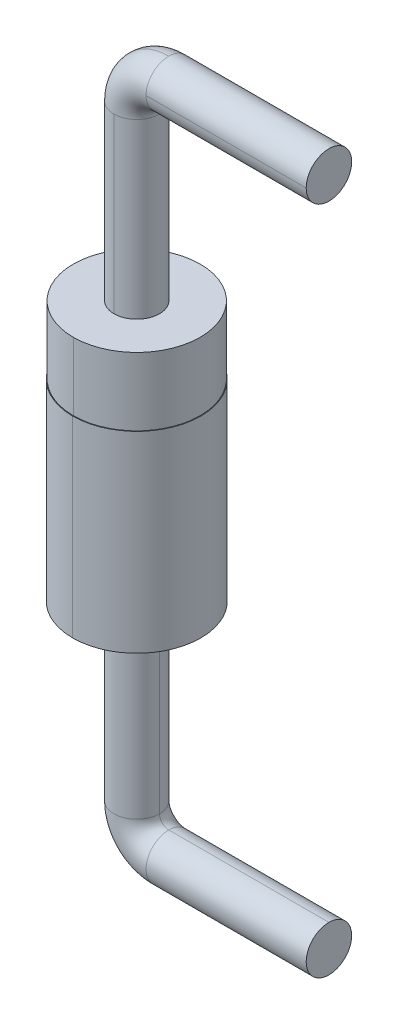
ISO-10303-21;
HEADER;
FILE_DESCRIPTION(('STEP AP214'),'2;1');
FILE_NAME('part.step','',(''),(''),'','','');
FILE_SCHEMA(('AUTOMOTIVE_DESIGN { 1 0 10303 214 1 1 1 1 }'));
ENDSEC;
DATA;
#1=APPLICATION_CONTEXT('core data for automotive mechanical design processes');
#2=APPLICATION_PROTOCOL_DEFINITION('international standard','automotive_design',2000,#1);
#3=PRODUCT_CONTEXT('',#1,'mechanical');
#4=PRODUCT('Part','Part','',(#3));
#5=PRODUCT_RELATED_PRODUCT_CATEGORY('part','',(#4));
#6=PRODUCT_DEFINITION_FORMATION('','',#4);
#7=PRODUCT_DEFINITION_CONTEXT('part definition',#1,'design');
#8=PRODUCT_DEFINITION('design','',#6,#7);
#9=PRODUCT_DEFINITION_SHAPE('','',#8);
#10=(LENGTH_UNIT() NAMED_UNIT(*) SI_UNIT(.MILLI.,.METRE.));
#11=(NAMED_UNIT(*) PLANE_ANGLE_UNIT() SI_UNIT($,.RADIAN.));
#12=(NAMED_UNIT(*) SI_UNIT($,.STERADIAN.) SOLID_ANGLE_UNIT());
#13=UNCERTAINTY_MEASURE_WITH_UNIT(LENGTH_MEASURE(1.E-05),#10,'distance_accuracy_value','');
#14=(GEOMETRIC_REPRESENTATION_CONTEXT(3) GLOBAL_UNCERTAINTY_ASSIGNED_CONTEXT((#13)) GLOBAL_UNIT_ASSIGNED_CONTEXT((#10,
#11,#12)) REPRESENTATION_CONTEXT('',''));
#15=CARTESIAN_POINT('',(0.,0.,0.));
#16=DIRECTION('',(0.,0.,1.));
#17=DIRECTION('',(1.,0.,0.));
#18=AXIS2_PLACEMENT_3D('',#15,#16,#17);
#19=CARTESIAN_POINT('',(3.,-3.2,0.));
#20=DIRECTION('',(1.,0.,0.));
#21=DIRECTION('',(0.,1.,0.));
#22=AXIS2_PLACEMENT_3D('',#19,#20,#21);
#23=PLANE('',#22);
#24=CARTESIAN_POINT('',(3.,-3.2,0.));
#25=DIRECTION('',(1.,0.,0.));
#26=DIRECTION('',(0.,0.,-1.));
#27=AXIS2_PLACEMENT_3D('',#24,#25,#26);
#28=CIRCLE('',#27,0.355);
#29=CARTESIAN_POINT('',(3.,-2.845,0.));
#30=VERTEX_POINT('',#29);
#31=CARTESIAN_POINT('',(3.,-3.555,0.));
#32=VERTEX_POINT('',#31);
#33=EDGE_CURVE('E278',#30,#32,#28,.T.);
#34=ORIENTED_EDGE('',*,*,#33,.T.);
#35=CARTESIAN_POINT('',(3.,-3.2,0.));
#36=DIRECTION('',(1.,0.,0.));
#37=DIRECTION('',(0.,0.,-1.));
#38=AXIS2_PLACEMENT_3D('',#35,#36,#37);
#39=CIRCLE('',#38,0.355);
#40=EDGE_CURVE('E28',#32,#30,#39,.T.);
#41=ORIENTED_EDGE('',*,*,#40,.T.);
#42=EDGE_LOOP('',(#34,#41));
#43=FACE_BOUND('',#42,.T.);
#44=ADVANCED_FACE('F17',(#43),#23,.T.);
#45=CARTESIAN_POINT('',(0.,0.,0.));
#46=DIRECTION('',(0.,-1.,0.));
#47=DIRECTION('',(1.,0.,0.));
#48=AXIS2_PLACEMENT_3D('',#45,#46,#47);
#49=CYLINDRICAL_SURFACE('',#48,0.355);
#50=DIRECTION('',(0.,-1.,0.));
#51=VECTOR('',#50,1.);
#52=CARTESIAN_POINT('',(-0.355,0.,0.));
#53=LINE('',#52,#51);
#54=CARTESIAN_POINT('',(-0.355,0.,0.));
#55=VERTEX_POINT('',#54);
#56=CARTESIAN_POINT('',(-0.355,-2.7,0.));
#57=VERTEX_POINT('',#56);
#58=EDGE_CURVE('E210',#55,#57,#53,.T.);
#59=ORIENTED_EDGE('',*,*,#58,.F.);
#60=CARTESIAN_POINT('',(0.,0.,0.));
#61=DIRECTION('',(0.,-1.,0.));
#62=DIRECTION('',(0.,0.,-1.));
#63=AXIS2_PLACEMENT_3D('',#60,#61,#62);
#64=CIRCLE('',#63,0.355);
#65=CARTESIAN_POINT('',(0.355,0.,0.));
#66=VERTEX_POINT('',#65);
#67=EDGE_CURVE('E257',#55,#66,#64,.T.);
#68=ORIENTED_EDGE('',*,*,#67,.T.);
#69=DIRECTION('',(0.,-1.,0.));
#70=VECTOR('',#69,1.);
#71=CARTESIAN_POINT('',(0.355,0.,0.));
#72=LINE('',#71,#70);
#73=CARTESIAN_POINT('',(0.355,-2.7,0.));
#74=VERTEX_POINT('',#73);
#75=EDGE_CURVE('E176',#66,#74,#72,.T.);
#76=ORIENTED_EDGE('',*,*,#75,.T.);
#77=CARTESIAN_POINT('',(0.,-2.7,0.));
#78=DIRECTION('',(0.,-1.,0.));
#79=DIRECTION('',(0.,0.,-1.));
#80=AXIS2_PLACEMENT_3D('',#77,#78,#79);
#81=CIRCLE('',#80,0.355);
#82=EDGE_CURVE('E11',#57,#74,#81,.T.);
#83=ORIENTED_EDGE('',*,*,#82,.F.);
#84=EDGE_LOOP('',(#59,#68,#76,#83));
#85=FACE_BOUND('',#84,.T.);
#86=ADVANCED_FACE('F353',(#85),#49,.T.);
#87=CARTESIAN_POINT('',(0.5,-2.7,0.));
#88=DIRECTION('',(0.,0.,1.));
#89=DIRECTION('',(1.,0.,0.));
#90=AXIS2_PLACEMENT_3D('',#87,#88,#89);
#91=TOROIDAL_SURFACE('',#90,0.5,0.355);
#92=CARTESIAN_POINT('',(0.5,-2.7,0.));
#93=DIRECTION('',(0.,0.,1.));
#94=DIRECTION('',(1.,0.,0.));
#95=AXIS2_PLACEMENT_3D('',#92,#93,#94);
#96=CIRCLE('',#95,0.855);
#97=CARTESIAN_POINT('',(0.5,-3.555,0.));
#98=VERTEX_POINT('',#97);
#99=EDGE_CURVE('E198',#57,#98,#96,.T.);
#100=ORIENTED_EDGE('',*,*,#99,.F.);
#101=ORIENTED_EDGE('',*,*,#82,.T.);
#102=CARTESIAN_POINT('',(0.5,-2.7,0.));
#103=DIRECTION('',(0.,0.,1.));
#104=DIRECTION('',(1.,0.,0.));
#105=AXIS2_PLACEMENT_3D('',#102,#103,#104);
#106=CIRCLE('',#105,0.145);
#107=CARTESIAN_POINT('',(0.5,-2.845,0.));
#108=VERTEX_POINT('',#107);
#109=EDGE_CURVE('E193',#74,#108,#106,.T.);
#110=ORIENTED_EDGE('',*,*,#109,.T.);
#111=CARTESIAN_POINT('',(0.5,-3.2,0.));
#112=DIRECTION('',(1.,0.,0.));
#113=DIRECTION('',(0.,0.,-1.));
#114=AXIS2_PLACEMENT_3D('',#111,#112,#113);
#115=CIRCLE('',#114,0.355);
#116=EDGE_CURVE('E189',#98,#108,#115,.T.);
#117=ORIENTED_EDGE('',*,*,#116,.F.);
#118=EDGE_LOOP('',(#100,#101,#110,#117));
#119=FACE_BOUND('',#118,.T.);
#120=ADVANCED_FACE('F302',(#119),#91,.T.);
#121=CARTESIAN_POINT('',(0.5,-3.2,0.));
#122=DIRECTION('',(1.,0.,0.));
#123=DIRECTION('',(0.,1.,0.));
#124=AXIS2_PLACEMENT_3D('',#121,#122,#123);
#125=CYLINDRICAL_SURFACE('',#124,0.355);
#126=DIRECTION('',(1.,0.,0.));
#127=VECTOR('',#126,1.);
#128=CARTESIAN_POINT('',(0.5,-3.555,0.));
#129=LINE('',#128,#127);
#130=EDGE_CURVE('E272',#98,#32,#129,.T.);
#131=ORIENTED_EDGE('',*,*,#130,.F.);
#132=ORIENTED_EDGE('',*,*,#116,.T.);
#133=DIRECTION('',(1.,0.,0.));
#134=VECTOR('',#133,1.);
#135=CARTESIAN_POINT('',(0.5,-2.845,0.));
#136=LINE('',#135,#134);
#137=EDGE_CURVE('E211',#108,#30,#136,.T.);
#138=ORIENTED_EDGE('',*,*,#137,.T.);
#139=ORIENTED_EDGE('',*,*,#40,.F.);
#140=EDGE_LOOP('',(#131,#132,#138,#139));
#141=FACE_BOUND('',#140,.T.);
#142=ADVANCED_FACE('F305',(#141),#125,.T.);
#143=CARTESIAN_POINT('',(3.,7.26,0.));
#144=DIRECTION('',(1.,0.,0.));
#145=DIRECTION('',(0.,1.,0.));
#146=AXIS2_PLACEMENT_3D('',#143,#144,#145);
#147=PLANE('',#146);
#148=CARTESIAN_POINT('',(3.,7.26,0.));
#149=DIRECTION('',(1.,0.,0.));
#150=DIRECTION('',(0.,0.,1.));
#151=AXIS2_PLACEMENT_3D('',#148,#149,#150);
#152=CIRCLE('',#151,0.355);
#153=CARTESIAN_POINT('',(3.,7.26,-0.355));
#154=VERTEX_POINT('',#153);
#155=CARTESIAN_POINT('',(3.,7.26,0.355));
#156=VERTEX_POINT('',#155);
#157=EDGE_CURVE('E172',#154,#156,#152,.T.);
#158=ORIENTED_EDGE('',*,*,#157,.T.);
#159=CARTESIAN_POINT('',(3.,7.26,0.));
#160=DIRECTION('',(1.,0.,0.));
#161=DIRECTION('',(0.,0.,1.));
#162=AXIS2_PLACEMENT_3D('',#159,#160,#161);
#163=CIRCLE('',#162,0.355);
#164=EDGE_CURVE('E227',#156,#154,#163,.T.);
#165=ORIENTED_EDGE('',*,*,#164,.T.);
#166=EDGE_LOOP('',(#158,#165));
#167=FACE_BOUND('',#166,.T.);
#168=ADVANCED_FACE('F225',(#167),#147,.T.);
#169=CARTESIAN_POINT('',(0.,4.06,0.));
#170=DIRECTION('',(0.,1.,0.));
#171=DIRECTION('',(0.,0.,1.));
#172=AXIS2_PLACEMENT_3D('',#169,#170,#171);
#173=CYLINDRICAL_SURFACE('',#172,0.355);
#174=DIRECTION('',(0.,1.,0.));
#175=VECTOR('',#174,1.);
#176=CARTESIAN_POINT('',(0.,4.06,-0.355));
#177=LINE('',#176,#175);
#178=CARTESIAN_POINT('',(0.,4.06,-0.355));
#179=VERTEX_POINT('',#178);
#180=CARTESIAN_POINT('',(0.,6.76,-0.355));
#181=VERTEX_POINT('',#180);
#182=EDGE_CURVE('E151',#179,#181,#177,.T.);
#183=ORIENTED_EDGE('',*,*,#182,.F.);
#184=CARTESIAN_POINT('',(0.,4.06,0.));
#185=DIRECTION('',(0.,1.,0.));
#186=DIRECTION('',(0.,0.,1.));
#187=AXIS2_PLACEMENT_3D('',#184,#185,#186);
#188=CIRCLE('',#187,0.355);
#189=CARTESIAN_POINT('',(0.,4.06,0.355));
#190=VERTEX_POINT('',#189);
#191=EDGE_CURVE('E21',#179,#190,#188,.T.);
#192=ORIENTED_EDGE('',*,*,#191,.T.);
#193=DIRECTION('',(0.,1.,0.));
#194=VECTOR('',#193,1.);
#195=CARTESIAN_POINT('',(0.,4.06,0.355));
#196=LINE('',#195,#194);
#197=CARTESIAN_POINT('',(0.,6.76,0.355));
#198=VERTEX_POINT('',#197);
#199=EDGE_CURVE('E163',#190,#198,#196,.T.);
#200=ORIENTED_EDGE('',*,*,#199,.T.);
#201=CARTESIAN_POINT('',(0.,6.76,0.));
#202=DIRECTION('',(0.,1.,0.));
#203=DIRECTION('',(0.,0.,1.));
#204=AXIS2_PLACEMENT_3D('',#201,#202,#203);
#205=CIRCLE('',#204,0.355);
#206=CARTESIAN_POINT('',(-0.355,6.76,0.));
#207=VERTEX_POINT('',#206);
#208=EDGE_CURVE('E192',#207,#198,#205,.T.);
#209=ORIENTED_EDGE('',*,*,#208,.F.);
#210=CARTESIAN_POINT('',(0.,6.76,0.));
#211=DIRECTION('',(0.,1.,0.));
#212=DIRECTION('',(0.,0.,1.));
#213=AXIS2_PLACEMENT_3D('',#210,#211,#212);
#214=CIRCLE('',#213,0.355);
#215=EDGE_CURVE('E154',#181,#207,#214,.T.);
#216=ORIENTED_EDGE('',*,*,#215,.F.);
#217=EDGE_LOOP('',(#183,#192,#200,#209,#216));
#218=FACE_BOUND('',#217,.T.);
#219=ADVANCED_FACE('F152',(#218),#173,.T.);
#220=CARTESIAN_POINT('',(0.5,6.76,0.));
#221=DIRECTION('',(0.,0.,-1.));
#222=DIRECTION('',(-1.,0.,0.));
#223=AXIS2_PLACEMENT_3D('',#220,#221,#222);
#224=TOROIDAL_SURFACE('',#223,0.5,0.355);
#225=CARTESIAN_POINT('',(0.5,6.76,0.));
#226=DIRECTION('',(0.,0.,-1.));
#227=DIRECTION('',(-1.,0.,0.));
#228=AXIS2_PLACEMENT_3D('',#225,#226,#227);
#229=CIRCLE('',#228,0.855);
#230=CARTESIAN_POINT('',(0.5,7.615,0.));
#231=VERTEX_POINT('',#230);
#232=EDGE_CURVE('E250',#207,#231,#229,.T.);
#233=ORIENTED_EDGE('',*,*,#232,.F.);
#234=ORIENTED_EDGE('',*,*,#208,.T.);
#235=CARTESIAN_POINT('',(0.,6.76,0.));
#236=DIRECTION('',(0.,1.,0.));
#237=DIRECTION('',(0.,0.,1.));
#238=AXIS2_PLACEMENT_3D('',#235,#236,#237);
#239=CIRCLE('',#238,0.355);
#240=CARTESIAN_POINT('',(0.355,6.76,0.));
#241=VERTEX_POINT('',#240);
#242=EDGE_CURVE('E159',#198,#241,#239,.T.);
#243=ORIENTED_EDGE('',*,*,#242,.T.);
#244=CARTESIAN_POINT('',(0.5,6.76,0.));
#245=DIRECTION('',(0.,0.,-1.));
#246=DIRECTION('',(-1.,0.,0.));
#247=AXIS2_PLACEMENT_3D('',#244,#245,#246);
#248=CIRCLE('',#247,0.145);
#249=CARTESIAN_POINT('',(0.5,6.905,0.));
#250=VERTEX_POINT('',#249);
#251=EDGE_CURVE('E259',#241,#250,#248,.T.);
#252=ORIENTED_EDGE('',*,*,#251,.T.);
#253=CARTESIAN_POINT('',(0.5,7.26,0.));
#254=DIRECTION('',(1.,0.,0.));
#255=DIRECTION('',(0.,0.,1.));
#256=AXIS2_PLACEMENT_3D('',#253,#254,#255);
#257=CIRCLE('',#256,0.355);
#258=CARTESIAN_POINT('',(0.5,7.26,0.355));
#259=VERTEX_POINT('',#258);
#260=EDGE_CURVE('E148',#259,#250,#257,.T.);
#261=ORIENTED_EDGE('',*,*,#260,.F.);
#262=CARTESIAN_POINT('',(0.5,7.26,0.));
#263=DIRECTION('',(1.,0.,0.));
#264=DIRECTION('',(0.,0.,1.));
#265=AXIS2_PLACEMENT_3D('',#262,#263,#264);
#266=CIRCLE('',#265,0.355);
#267=EDGE_CURVE('E182',#231,#259,#266,.T.);
#268=ORIENTED_EDGE('',*,*,#267,.F.);
#269=EDGE_LOOP('',(#233,#234,#243,#252,#261,#268));
#270=FACE_BOUND('',#269,.T.);
#271=ADVANCED_FACE('F340',(#270),#224,.T.);
#272=CARTESIAN_POINT('',(0.5,7.26,0.));
#273=DIRECTION('',(1.,0.,0.));
#274=DIRECTION('',(0.,0.,-1.));
#275=AXIS2_PLACEMENT_3D('',#272,#273,#274);
#276=CYLINDRICAL_SURFACE('',#275,0.355);
#277=DIRECTION('',(1.,0.,0.));
#278=VECTOR('',#277,1.);
#279=CARTESIAN_POINT('',(0.5,7.26,0.355));
#280=LINE('',#279,#278);
#281=EDGE_CURVE('E178',#259,#156,#280,.T.);
#282=ORIENTED_EDGE('',*,*,#281,.F.);
#283=ORIENTED_EDGE('',*,*,#260,.T.);
#284=CARTESIAN_POINT('',(0.5,7.26,0.));
#285=DIRECTION('',(1.,0.,0.));
#286=DIRECTION('',(0.,0.,1.));
#287=AXIS2_PLACEMENT_3D('',#284,#285,#286);
#288=CIRCLE('',#287,0.355);
#289=CARTESIAN_POINT('',(0.5,7.26,-0.355));
#290=VERTEX_POINT('',#289);
#291=EDGE_CURVE('E263',#250,#290,#288,.T.);
#292=ORIENTED_EDGE('',*,*,#291,.T.);
#293=DIRECTION('',(1.,0.,0.));
#294=VECTOR('',#293,1.);
#295=CARTESIAN_POINT('',(0.5,7.26,-0.355));
#296=LINE('',#295,#294);
#297=EDGE_CURVE('E165',#290,#154,#296,.T.);
#298=ORIENTED_EDGE('',*,*,#297,.T.);
#299=ORIENTED_EDGE('',*,*,#164,.F.);
#300=EDGE_LOOP('',(#282,#283,#292,#298,#299));
#301=FACE_BOUND('',#300,.T.);
#302=ADVANCED_FACE('F235',(#301),#276,.T.);
#303=CARTESIAN_POINT('',(0.,4.06,0.));
#304=DIRECTION('',(0.,1.,0.));
#305=DIRECTION('',(1.,0.,0.));
#306=AXIS2_PLACEMENT_3D('',#303,#304,#305);
#307=PLANE('',#306);
#308=CARTESIAN_POINT('',(0.,4.06,0.));
#309=DIRECTION('',(0.,1.,0.));
#310=DIRECTION('',(0.,0.,1.));
#311=AXIS2_PLACEMENT_3D('',#308,#309,#310);
#312=CIRCLE('',#311,0.99);
#313=CARTESIAN_POINT('',(0.,4.06,-0.99));
#314=VERTEX_POINT('',#313);
#315=CARTESIAN_POINT('',(0.,4.06,0.99));
#316=VERTEX_POINT('',#315);
#317=EDGE_CURVE('E149',#314,#316,#312,.T.);
#318=ORIENTED_EDGE('',*,*,#317,.T.);
#319=CARTESIAN_POINT('',(0.,4.06,0.));
#320=DIRECTION('',(0.,1.,0.));
#321=DIRECTION('',(0.,0.,1.));
#322=AXIS2_PLACEMENT_3D('',#319,#320,#321);
#323=CIRCLE('',#322,0.99);
#324=EDGE_CURVE('E188',#316,#314,#323,.T.);
#325=ORIENTED_EDGE('',*,*,#324,.T.);
#326=EDGE_LOOP('',(#318,#325));
#327=FACE_BOUND('',#326,.T.);
#328=CARTESIAN_POINT('',(0.,4.06,0.));
#329=DIRECTION('',(0.,1.,0.));
#330=DIRECTION('',(0.,0.,1.));
#331=AXIS2_PLACEMENT_3D('',#328,#329,#330);
#332=CIRCLE('',#331,0.355);
#333=EDGE_CURVE('E143',#190,#179,#332,.T.);
#334=ORIENTED_EDGE('',*,*,#333,.F.);
#335=ORIENTED_EDGE('',*,*,#191,.F.);
#336=EDGE_LOOP('',(#334,#335));
#337=FACE_BOUND('',#336,.T.);
#338=ADVANCED_FACE('F141',(#327,#337),#307,.T.);
#339=CARTESIAN_POINT('',(0.,4.06,0.));
#340=DIRECTION('',(0.,-1.,0.));
#341=DIRECTION('',(0.,0.,-1.));
#342=AXIS2_PLACEMENT_3D('',#339,#340,#341);
#343=CYLINDRICAL_SURFACE('',#342,0.99);
#344=DIRECTION('',(0.,-1.,0.));
#345=VECTOR('',#344,1.);
#346=CARTESIAN_POINT('',(0.,4.06,0.99));
#347=LINE('',#346,#345);
#348=CARTESIAN_POINT('',(0.,3.,0.99));
#349=VERTEX_POINT('',#348);
#350=EDGE_CURVE('E183',#316,#349,#347,.T.);
#351=ORIENTED_EDGE('',*,*,#350,.F.);
#352=ORIENTED_EDGE('',*,*,#317,.F.);
#353=DIRECTION('',(0.,-1.,0.));
#354=VECTOR('',#353,1.);
#355=CARTESIAN_POINT('',(0.,4.06,-0.99));
#356=LINE('',#355,#354);
#357=CARTESIAN_POINT('',(0.,3.,-0.99));
#358=VERTEX_POINT('',#357);
#359=EDGE_CURVE('E329',#314,#358,#356,.T.);
#360=ORIENTED_EDGE('',*,*,#359,.T.);
#361=CARTESIAN_POINT('',(0.,3.,0.));
#362=DIRECTION('',(0.,1.,0.));
#363=DIRECTION('',(0.,0.,1.));
#364=AXIS2_PLACEMENT_3D('',#361,#362,#363);
#365=CIRCLE('',#364,0.99);
#366=EDGE_CURVE('E255',#358,#349,#365,.T.);
#367=ORIENTED_EDGE('',*,*,#366,.T.);
#368=EDGE_LOOP('',(#351,#352,#360,#367));
#369=FACE_BOUND('',#368,.T.);
#370=ADVANCED_FACE('F380',(#369),#343,.T.);
#371=CARTESIAN_POINT('',(0.,0.,0.));
#372=DIRECTION('',(0.,1.,0.));
#373=DIRECTION('',(1.,0.,0.));
#374=AXIS2_PLACEMENT_3D('',#371,#372,#373);
#375=PLANE('',#374);
#376=CARTESIAN_POINT('',(0.,0.,0.));
#377=DIRECTION('',(0.,1.,0.));
#378=DIRECTION('',(0.,0.,1.));
#379=AXIS2_PLACEMENT_3D('',#376,#377,#378);
#380=CIRCLE('',#379,1.);
#381=CARTESIAN_POINT('',(0.,0.,-1.));
#382=VERTEX_POINT('',#381);
#383=CARTESIAN_POINT('',(0.,0.,1.));
#384=VERTEX_POINT('',#383);
#385=EDGE_CURVE('E41',#382,#384,#380,.T.);
#386=ORIENTED_EDGE('',*,*,#385,.F.);
#387=CARTESIAN_POINT('',(0.,0.,0.));
#388=DIRECTION('',(0.,1.,0.));
#389=DIRECTION('',(0.,0.,1.));
#390=AXIS2_PLACEMENT_3D('',#387,#388,#389);
#391=CIRCLE('',#390,1.);
#392=EDGE_CURVE('E215',#384,#382,#391,.T.);
#393=ORIENTED_EDGE('',*,*,#392,.F.);
#394=EDGE_LOOP('',(#386,#393));
#395=FACE_BOUND('',#394,.T.);
#396=CARTESIAN_POINT('',(0.,0.,0.));
#397=DIRECTION('',(0.,-1.,0.));
#398=DIRECTION('',(0.,0.,-1.));
#399=AXIS2_PLACEMENT_3D('',#396,#397,#398);
#400=CIRCLE('',#399,0.355);
#401=EDGE_CURVE('E206',#66,#55,#400,.T.);
#402=ORIENTED_EDGE('',*,*,#401,.F.);
#403=ORIENTED_EDGE('',*,*,#67,.F.);
#404=EDGE_LOOP('',(#402,#403));
#405=FACE_BOUND('',#404,.T.);
#406=ADVANCED_FACE('F19',(#395,#405),#375,.F.);
#407=CARTESIAN_POINT('',(0.,3.,0.));
#408=DIRECTION('',(0.,1.,0.));
#409=DIRECTION('',(1.,0.,0.));
#410=AXIS2_PLACEMENT_3D('',#407,#408,#409);
#411=PLANE('',#410);
#412=CARTESIAN_POINT('',(0.,3.,0.));
#413=DIRECTION('',(0.,1.,0.));
#414=DIRECTION('',(0.,0.,1.));
#415=AXIS2_PLACEMENT_3D('',#412,#413,#414);
#416=CIRCLE('',#415,1.);
#417=CARTESIAN_POINT('',(0.,3.,-1.));
#418=VERTEX_POINT('',#417);
#419=CARTESIAN_POINT('',(0.,3.,1.));
#420=VERTEX_POINT('',#419);
#421=EDGE_CURVE('E214',#418,#420,#416,.T.);
#422=ORIENTED_EDGE('',*,*,#421,.T.);
#423=CARTESIAN_POINT('',(0.,3.,0.));
#424=DIRECTION('',(0.,1.,0.));
#425=DIRECTION('',(0.,0.,1.));
#426=AXIS2_PLACEMENT_3D('',#423,#424,#425);
#427=CIRCLE('',#426,1.);
#428=EDGE_CURVE('E325',#420,#418,#427,.T.);
#429=ORIENTED_EDGE('',*,*,#428,.T.);
#430=EDGE_LOOP('',(#422,#429));
#431=FACE_BOUND('',#430,.T.);
#432=ORIENTED_EDGE('',*,*,#366,.F.);
#433=CARTESIAN_POINT('',(0.,3.,0.));
#434=DIRECTION('',(0.,1.,0.));
#435=DIRECTION('',(0.,0.,1.));
#436=AXIS2_PLACEMENT_3D('',#433,#434,#435);
#437=CIRCLE('',#436,0.99);
#438=EDGE_CURVE('E187',#349,#358,#437,.T.);
#439=ORIENTED_EDGE('',*,*,#438,.F.);
#440=EDGE_LOOP('',(#432,#439));
#441=FACE_BOUND('',#440,.T.);
#442=ADVANCED_FACE('F370',(#431,#441),#411,.T.);
#443=CARTESIAN_POINT('',(0.,3.,0.));
#444=DIRECTION('',(0.,-1.,0.));
#445=DIRECTION('',(0.,0.,-1.));
#446=AXIS2_PLACEMENT_3D('',#443,#444,#445);
#447=CYLINDRICAL_SURFACE('',#446,1.);
#448=DIRECTION('',(0.,-1.,0.));
#449=VECTOR('',#448,1.);
#450=CARTESIAN_POINT('',(0.,3.,1.));
#451=LINE('',#450,#449);
#452=EDGE_CURVE('E267',#420,#384,#451,.T.);
#453=ORIENTED_EDGE('',*,*,#452,.F.);
#454=ORIENTED_EDGE('',*,*,#421,.F.);
#455=DIRECTION('',(0.,-1.,0.));
#456=VECTOR('',#455,1.);
#457=CARTESIAN_POINT('',(0.,3.,-1.));
#458=LINE('',#457,#456);
#459=EDGE_CURVE('E212',#418,#382,#458,.T.);
#460=ORIENTED_EDGE('',*,*,#459,.T.);
#461=ORIENTED_EDGE('',*,*,#385,.T.);
#462=EDGE_LOOP('',(#453,#454,#460,#461));
#463=FACE_BOUND('',#462,.T.);
#464=ADVANCED_FACE('F372',(#463),#447,.T.);
#465=CARTESIAN_POINT('',(0.,3.,0.));
#466=DIRECTION('',(0.,-1.,0.));
#467=DIRECTION('',(0.,0.,-1.));
#468=AXIS2_PLACEMENT_3D('',#465,#466,#467);
#469=CYLINDRICAL_SURFACE('',#468,1.);
#470=ORIENTED_EDGE('',*,*,#428,.F.);
#471=ORIENTED_EDGE('',*,*,#452,.T.);
#472=ORIENTED_EDGE('',*,*,#392,.T.);
#473=ORIENTED_EDGE('',*,*,#459,.F.);
#474=EDGE_LOOP('',(#470,#471,#472,#473));
#475=FACE_BOUND('',#474,.T.);
#476=ADVANCED_FACE('F377',(#475),#469,.T.);
#477=CARTESIAN_POINT('',(0.,4.06,0.));
#478=DIRECTION('',(0.,-1.,0.));
#479=DIRECTION('',(0.,0.,-1.));
#480=AXIS2_PLACEMENT_3D('',#477,#478,#479);
#481=CYLINDRICAL_SURFACE('',#480,0.99);
#482=ORIENTED_EDGE('',*,*,#324,.F.);
#483=ORIENTED_EDGE('',*,*,#350,.T.);
#484=ORIENTED_EDGE('',*,*,#438,.T.);
#485=ORIENTED_EDGE('',*,*,#359,.F.);
#486=EDGE_LOOP('',(#482,#483,#484,#485));
#487=FACE_BOUND('',#486,.T.);
#488=ADVANCED_FACE('F369',(#487),#481,.T.);
#489=CARTESIAN_POINT('',(0.,4.06,0.));
#490=DIRECTION('',(0.,1.,0.));
#491=DIRECTION('',(0.,0.,1.));
#492=AXIS2_PLACEMENT_3D('',#489,#490,#491);
#493=CYLINDRICAL_SURFACE('',#492,0.355);
#494=ORIENTED_EDGE('',*,*,#333,.T.);
#495=ORIENTED_EDGE('',*,*,#182,.T.);
#496=CARTESIAN_POINT('',(0.,6.76,0.));
#497=DIRECTION('',(0.,1.,0.));
#498=DIRECTION('',(0.,0.,1.));
#499=AXIS2_PLACEMENT_3D('',#496,#497,#498);
#500=CIRCLE('',#499,0.355);
#501=EDGE_CURVE('E262',#241,#181,#500,.T.);
#502=ORIENTED_EDGE('',*,*,#501,.F.);
#503=ORIENTED_EDGE('',*,*,#242,.F.);
#504=ORIENTED_EDGE('',*,*,#199,.F.);
#505=EDGE_LOOP('',(#494,#495,#502,#503,#504));
#506=FACE_BOUND('',#505,.T.);
#507=ADVANCED_FACE('F161',(#506),#493,.T.);
#508=CARTESIAN_POINT('',(0.5,7.26,0.));
#509=DIRECTION('',(1.,0.,0.));
#510=DIRECTION('',(0.,0.,-1.));
#511=AXIS2_PLACEMENT_3D('',#508,#509,#510);
#512=CYLINDRICAL_SURFACE('',#511,0.355);
#513=CARTESIAN_POINT('',(0.5,7.26,0.));
#514=DIRECTION('',(1.,0.,0.));
#515=DIRECTION('',(0.,0.,1.));
#516=AXIS2_PLACEMENT_3D('',#513,#514,#515);
#517=CIRCLE('',#516,0.355);
#518=EDGE_CURVE('E254',#290,#231,#517,.T.);
#519=ORIENTED_EDGE('',*,*,#518,.T.);
#520=ORIENTED_EDGE('',*,*,#267,.T.);
#521=ORIENTED_EDGE('',*,*,#281,.T.);
#522=ORIENTED_EDGE('',*,*,#157,.F.);
#523=ORIENTED_EDGE('',*,*,#297,.F.);
#524=EDGE_LOOP('',(#519,#520,#521,#522,#523));
#525=FACE_BOUND('',#524,.T.);
#526=ADVANCED_FACE('F233',(#525),#512,.T.);
#527=CARTESIAN_POINT('',(0.,0.,0.));
#528=DIRECTION('',(0.,-1.,0.));
#529=DIRECTION('',(1.,0.,0.));
#530=AXIS2_PLACEMENT_3D('',#527,#528,#529);
#531=CYLINDRICAL_SURFACE('',#530,0.355);
#532=ORIENTED_EDGE('',*,*,#401,.T.);
#533=ORIENTED_EDGE('',*,*,#58,.T.);
#534=CARTESIAN_POINT('',(0.,-2.7,0.));
#535=DIRECTION('',(0.,-1.,0.));
#536=DIRECTION('',(0.,0.,-1.));
#537=AXIS2_PLACEMENT_3D('',#534,#535,#536);
#538=CIRCLE('',#537,0.355);
#539=EDGE_CURVE('E202',#74,#57,#538,.T.);
#540=ORIENTED_EDGE('',*,*,#539,.F.);
#541=ORIENTED_EDGE('',*,*,#75,.F.);
#542=EDGE_LOOP('',(#532,#533,#540,#541));
#543=FACE_BOUND('',#542,.T.);
#544=ADVANCED_FACE('F364',(#543),#531,.T.);
#545=CARTESIAN_POINT('',(0.5,-3.2,0.));
#546=DIRECTION('',(1.,0.,0.));
#547=DIRECTION('',(0.,1.,0.));
#548=AXIS2_PLACEMENT_3D('',#545,#546,#547);
#549=CYLINDRICAL_SURFACE('',#548,0.355);
#550=CARTESIAN_POINT('',(0.5,-3.2,0.));
#551=DIRECTION('',(1.,0.,0.));
#552=DIRECTION('',(0.,0.,-1.));
#553=AXIS2_PLACEMENT_3D('',#550,#551,#552);
#554=CIRCLE('',#553,0.355);
#555=EDGE_CURVE('E197',#108,#98,#554,.T.);
#556=ORIENTED_EDGE('',*,*,#555,.T.);
#557=ORIENTED_EDGE('',*,*,#130,.T.);
#558=ORIENTED_EDGE('',*,*,#33,.F.);
#559=ORIENTED_EDGE('',*,*,#137,.F.);
#560=EDGE_LOOP('',(#556,#557,#558,#559));
#561=FACE_BOUND('',#560,.T.);
#562=ADVANCED_FACE('F292',(#561),#549,.T.);
#563=CARTESIAN_POINT('',(0.5,6.76,0.));
#564=DIRECTION('',(0.,0.,-1.));
#565=DIRECTION('',(-1.,0.,0.));
#566=AXIS2_PLACEMENT_3D('',#563,#564,#565);
#567=TOROIDAL_SURFACE('',#566,0.5,0.355);
#568=ORIENTED_EDGE('',*,*,#215,.T.);
#569=ORIENTED_EDGE('',*,*,#232,.T.);
#570=ORIENTED_EDGE('',*,*,#518,.F.);
#571=ORIENTED_EDGE('',*,*,#291,.F.);
#572=ORIENTED_EDGE('',*,*,#251,.F.);
#573=ORIENTED_EDGE('',*,*,#501,.T.);
#574=EDGE_LOOP('',(#568,#569,#570,#571,#572,#573));
#575=FACE_BOUND('',#574,.T.);
#576=ADVANCED_FACE('F338',(#575),#567,.T.);
#577=CARTESIAN_POINT('',(0.5,-2.7,0.));
#578=DIRECTION('',(0.,0.,1.));
#579=DIRECTION('',(1.,0.,0.));
#580=AXIS2_PLACEMENT_3D('',#577,#578,#579);
#581=TOROIDAL_SURFACE('',#580,0.5,0.355);
#582=ORIENTED_EDGE('',*,*,#539,.T.);
#583=ORIENTED_EDGE('',*,*,#99,.T.);
#584=ORIENTED_EDGE('',*,*,#555,.F.);
#585=ORIENTED_EDGE('',*,*,#109,.F.);
#586=EDGE_LOOP('',(#582,#583,#584,#585));
#587=FACE_BOUND('',#586,.T.);
#588=ADVANCED_FACE('F299',(#587),#581,.T.);
#589=CLOSED_SHELL('',(#44,#86,#120,#142,#168,#219,#271,#302,#338,#370,#406,#442,#464,#476,#488,
#507,#526,#544,#562,#576,#588));
#590=MANIFOLD_SOLID_BREP('B1',#589);
#591=ADVANCED_BREP_SHAPE_REPRESENTATION('',(#18,#590),#14);
#592=SHAPE_DEFINITION_REPRESENTATION(#9,#591);
ENDSEC;
END-ISO-10303-21;
